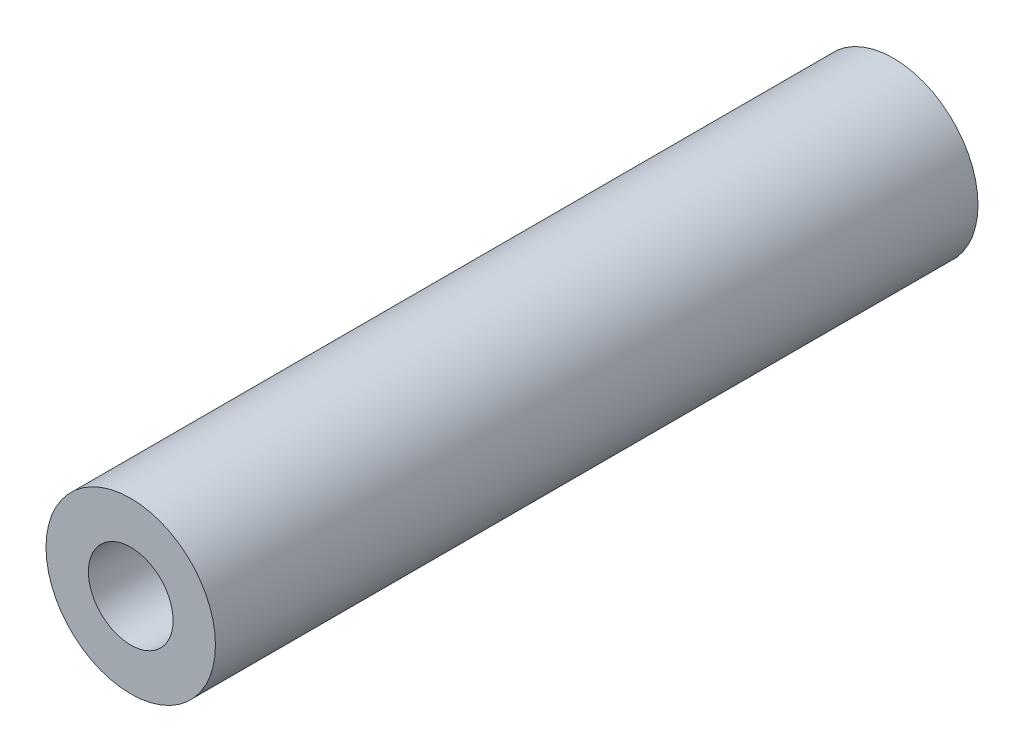
ISO-10303-21;
HEADER;
FILE_DESCRIPTION(('STEP AP214'),'2;1');
FILE_NAME('part.step','',(''),(''),'','','');
FILE_SCHEMA(('AUTOMOTIVE_DESIGN { 1 0 10303 214 1 1 1 1 }'));
ENDSEC;
DATA;
#1=APPLICATION_CONTEXT('core data for automotive mechanical design processes');
#2=APPLICATION_PROTOCOL_DEFINITION('international standard','automotive_design',2000,#1);
#3=PRODUCT_CONTEXT('',#1,'mechanical');
#4=PRODUCT('Part','Part','',(#3));
#5=PRODUCT_RELATED_PRODUCT_CATEGORY('part','',(#4));
#6=PRODUCT_DEFINITION_FORMATION('','',#4);
#7=PRODUCT_DEFINITION_CONTEXT('part definition',#1,'design');
#8=PRODUCT_DEFINITION('design','',#6,#7);
#9=PRODUCT_DEFINITION_SHAPE('','',#8);
#10=(LENGTH_UNIT() NAMED_UNIT(*) SI_UNIT(.MILLI.,.METRE.));
#11=(NAMED_UNIT(*) PLANE_ANGLE_UNIT() SI_UNIT($,.RADIAN.));
#12=(NAMED_UNIT(*) SI_UNIT($,.STERADIAN.) SOLID_ANGLE_UNIT());
#13=UNCERTAINTY_MEASURE_WITH_UNIT(LENGTH_MEASURE(1.E-05),#10,'distance_accuracy_value','');
#14=(GEOMETRIC_REPRESENTATION_CONTEXT(3) GLOBAL_UNCERTAINTY_ASSIGNED_CONTEXT((#13)) GLOBAL_UNIT_ASSIGNED_CONTEXT((#10,
#11,#12)) REPRESENTATION_CONTEXT('',''));
#15=CARTESIAN_POINT('',(0.,0.,0.));
#16=DIRECTION('',(0.,0.,1.));
#17=DIRECTION('',(1.,0.,0.));
#18=AXIS2_PLACEMENT_3D('',#15,#16,#17);
#19=CARTESIAN_POINT('',(0.,0.,36.));
#20=DIRECTION('',(0.,0.,1.));
#21=DIRECTION('',(1.,0.,0.));
#22=AXIS2_PLACEMENT_3D('',#19,#20,#21);
#23=PLANE('',#22);
#24=CARTESIAN_POINT('',(0.,0.,36.));
#25=DIRECTION('',(0.,0.,1.));
#26=DIRECTION('',(1.,0.,0.));
#27=AXIS2_PLACEMENT_3D('',#24,#25,#26);
#28=CIRCLE('',#27,4.);
#29=CARTESIAN_POINT('',(4.,0.,36.));
#30=VERTEX_POINT('',#29);
#31=EDGE_CURVE('E10',#30,#30,#28,.T.);
#32=ORIENTED_EDGE('',*,*,#31,.T.);
#33=EDGE_LOOP('',(#32));
#34=FACE_BOUND('',#33,.T.);
#35=CARTESIAN_POINT('',(0.,0.,36.));
#36=DIRECTION('',(0.,0.,1.));
#37=DIRECTION('',(1.,0.,0.));
#38=AXIS2_PLACEMENT_3D('',#35,#36,#37);
#39=CIRCLE('',#38,2.);
#40=CARTESIAN_POINT('',(2.,0.,36.));
#41=VERTEX_POINT('',#40);
#42=EDGE_CURVE('E50',#41,#41,#39,.T.);
#43=ORIENTED_EDGE('',*,*,#42,.F.);
#44=EDGE_LOOP('',(#43));
#45=FACE_BOUND('',#44,.T.);
#46=ADVANCED_FACE('F37',(#34,#45),#23,.T.);
#47=CARTESIAN_POINT('',(0.,0.,0.));
#48=DIRECTION('',(0.,0.,1.));
#49=DIRECTION('',(1.,0.,0.));
#50=AXIS2_PLACEMENT_3D('',#47,#48,#49);
#51=PLANE('',#50);
#52=CARTESIAN_POINT('',(0.,0.,0.));
#53=DIRECTION('',(0.,0.,1.));
#54=DIRECTION('',(1.,0.,0.));
#55=AXIS2_PLACEMENT_3D('',#52,#53,#54);
#56=CIRCLE('',#55,4.);
#57=CARTESIAN_POINT('',(4.,0.,0.));
#58=VERTEX_POINT('',#57);
#59=EDGE_CURVE('E41',#58,#58,#56,.T.);
#60=ORIENTED_EDGE('',*,*,#59,.F.);
#61=EDGE_LOOP('',(#60));
#62=FACE_BOUND('',#61,.T.);
#63=CARTESIAN_POINT('',(0.,0.,0.));
#64=DIRECTION('',(0.,0.,1.));
#65=DIRECTION('',(1.,0.,0.));
#66=AXIS2_PLACEMENT_3D('',#63,#64,#65);
#67=CIRCLE('',#66,2.);
#68=CARTESIAN_POINT('',(2.,0.,0.));
#69=VERTEX_POINT('',#68);
#70=EDGE_CURVE('E52',#69,#69,#67,.T.);
#71=ORIENTED_EDGE('',*,*,#70,.T.);
#72=EDGE_LOOP('',(#71));
#73=FACE_BOUND('',#72,.T.);
#74=ADVANCED_FACE('F64',(#62,#73),#51,.F.);
#75=CARTESIAN_POINT('',(0.,0.,36.));
#76=DIRECTION('',(0.,0.,-1.));
#77=DIRECTION('',(-1.,0.,0.));
#78=AXIS2_PLACEMENT_3D('',#75,#76,#77);
#79=CYLINDRICAL_SURFACE('',#78,4.);
#80=ORIENTED_EDGE('',*,*,#31,.F.);
#81=EDGE_LOOP('',(#80));
#82=FACE_BOUND('',#81,.T.);
#83=ORIENTED_EDGE('',*,*,#59,.T.);
#84=EDGE_LOOP('',(#83));
#85=FACE_BOUND('',#84,.T.);
#86=ADVANCED_FACE('F39',(#82,#85),#79,.T.);
#87=CARTESIAN_POINT('',(0.,0.,36.));
#88=DIRECTION('',(0.,0.,-1.));
#89=DIRECTION('',(-1.,0.,0.));
#90=AXIS2_PLACEMENT_3D('',#87,#88,#89);
#91=CYLINDRICAL_SURFACE('',#90,2.);
#92=ORIENTED_EDGE('',*,*,#42,.T.);
#93=EDGE_LOOP('',(#92));
#94=FACE_BOUND('',#93,.T.);
#95=ORIENTED_EDGE('',*,*,#70,.F.);
#96=EDGE_LOOP('',(#95));
#97=FACE_BOUND('',#96,.T.);
#98=ADVANCED_FACE('F60',(#94,#97),#91,.F.);
#99=CLOSED_SHELL('',(#46,#74,#86,#98));
#100=MANIFOLD_SOLID_BREP('B2',#99);
#101=ADVANCED_BREP_SHAPE_REPRESENTATION('',(#18,#100),#14);
#102=SHAPE_DEFINITION_REPRESENTATION(#9,#101);
ENDSEC;
END-ISO-10303-21;
